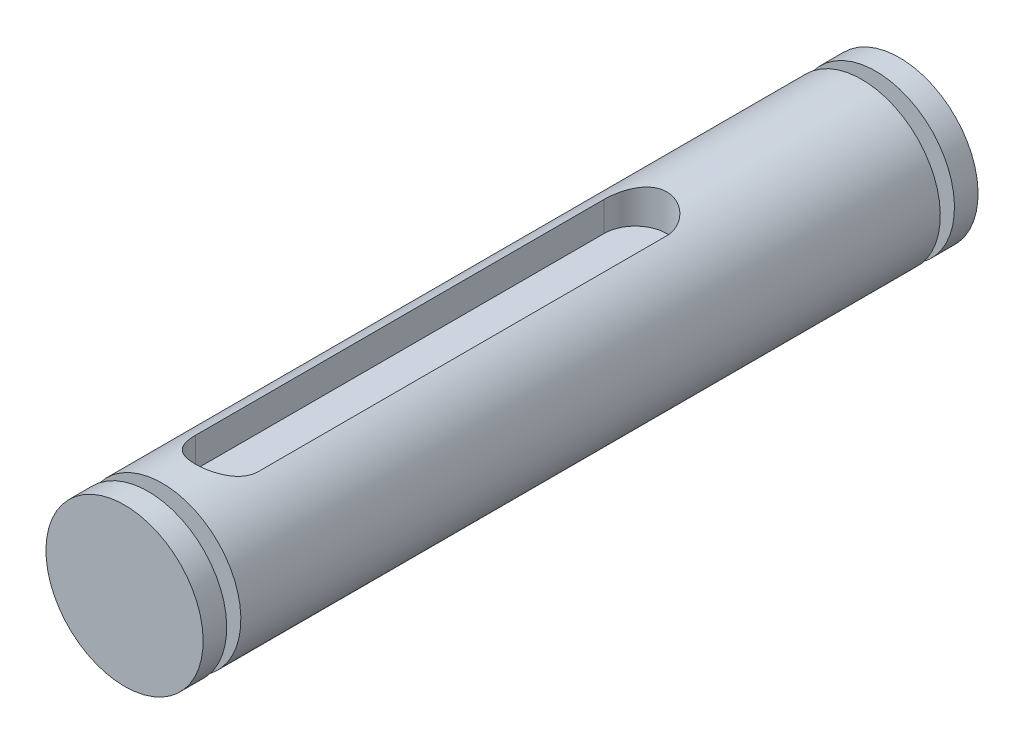
ISO-10303-21;
HEADER;
FILE_DESCRIPTION(('STEP AP214'),'2;1');
FILE_NAME('part.step','',(''),(''),'','','');
FILE_SCHEMA(('AUTOMOTIVE_DESIGN { 1 0 10303 214 1 1 1 1 }'));
ENDSEC;
DATA;
#1=APPLICATION_CONTEXT('core data for automotive mechanical design processes');
#2=APPLICATION_PROTOCOL_DEFINITION('international standard','automotive_design',2000,#1);
#3=PRODUCT_CONTEXT('',#1,'mechanical');
#4=PRODUCT('Part','Part','',(#3));
#5=PRODUCT_RELATED_PRODUCT_CATEGORY('part','',(#4));
#6=PRODUCT_DEFINITION_FORMATION('','',#4);
#7=PRODUCT_DEFINITION_CONTEXT('part definition',#1,'design');
#8=PRODUCT_DEFINITION('design','',#6,#7);
#9=PRODUCT_DEFINITION_SHAPE('','',#8);
#10=(LENGTH_UNIT() NAMED_UNIT(*) SI_UNIT(.MILLI.,.METRE.));
#11=(NAMED_UNIT(*) PLANE_ANGLE_UNIT() SI_UNIT($,.RADIAN.));
#12=(NAMED_UNIT(*) SI_UNIT($,.STERADIAN.) SOLID_ANGLE_UNIT());
#13=UNCERTAINTY_MEASURE_WITH_UNIT(LENGTH_MEASURE(1.E-05),#10,'distance_accuracy_value','');
#14=(GEOMETRIC_REPRESENTATION_CONTEXT(3) GLOBAL_UNCERTAINTY_ASSIGNED_CONTEXT((#13)) GLOBAL_UNIT_ASSIGNED_CONTEXT((#10,
#11,#12)) REPRESENTATION_CONTEXT('',''));
#15=CARTESIAN_POINT('',(0.,0.,0.));
#16=DIRECTION('',(0.,0.,1.));
#17=DIRECTION('',(1.,0.,0.));
#18=AXIS2_PLACEMENT_3D('',#15,#16,#17);
#19=CARTESIAN_POINT('',(0.,0.,0.));
#20=DIRECTION('',(0.,0.,1.));
#21=DIRECTION('',(0.,-1.,0.));
#22=AXIS2_PLACEMENT_3D('',#19,#20,#21);
#23=PLANE('',#22);
#24=CARTESIAN_POINT('',(0.,0.,0.));
#25=DIRECTION('',(0.,0.,1.));
#26=DIRECTION('',(0.,-1.,0.));
#27=AXIS2_PLACEMENT_3D('',#24,#25,#26);
#28=CIRCLE('',#27,5.);
#29=CARTESIAN_POINT('',(0.,-5.,0.));
#30=VERTEX_POINT('',#29);
#31=EDGE_CURVE('E20',#30,#30,#28,.F.);
#32=ORIENTED_EDGE('',*,*,#31,.F.);
#33=EDGE_LOOP('',(#32));
#34=FACE_BOUND('',#33,.T.);
#35=ADVANCED_FACE('F17',(#34),#23,.T.);
#36=CARTESIAN_POINT('',(0.,5.00000000000001,-49.3));
#37=DIRECTION('',(0.,0.,-1.));
#38=DIRECTION('',(0.,1.,0.));
#39=AXIS2_PLACEMENT_3D('',#36,#37,#38);
#40=PLANE('',#39);
#41=CARTESIAN_POINT('',(0.,0.,-49.3));
#42=DIRECTION('',(0.,0.,1.));
#43=DIRECTION('',(0.,-1.,0.));
#44=AXIS2_PLACEMENT_3D('',#41,#42,#43);
#45=CIRCLE('',#44,5.);
#46=CARTESIAN_POINT('',(0.,-4.99999999999999,-49.3));
#47=VERTEX_POINT('',#46);
#48=EDGE_CURVE('E143',#47,#47,#45,.T.);
#49=ORIENTED_EDGE('',*,*,#48,.F.);
#50=EDGE_LOOP('',(#49));
#51=FACE_BOUND('',#50,.T.);
#52=ADVANCED_FACE('F153',(#51),#40,.T.);
#53=CARTESIAN_POINT('',(0.,0.,-0.750000000000002));
#54=DIRECTION('',(0.,0.,1.));
#55=DIRECTION('',(0.,-1.,0.));
#56=AXIS2_PLACEMENT_3D('',#53,#54,#55);
#57=CYLINDRICAL_SURFACE('',#56,5.);
#58=CARTESIAN_POINT('',(0.,0.,-1.5));
#59=DIRECTION('',(0.,0.,1.));
#60=DIRECTION('',(0.,-1.,0.));
#61=AXIS2_PLACEMENT_3D('',#58,#59,#60);
#62=CIRCLE('',#61,5.);
#63=CARTESIAN_POINT('',(0.,-5.,-1.5));
#64=VERTEX_POINT('',#63);
#65=EDGE_CURVE('E141',#64,#64,#62,.F.);
#66=ORIENTED_EDGE('',*,*,#65,.F.);
#67=EDGE_LOOP('',(#66));
#68=FACE_BOUND('',#67,.T.);
#69=ORIENTED_EDGE('',*,*,#31,.T.);
#70=EDGE_LOOP('',(#69));
#71=FACE_BOUND('',#70,.T.);
#72=ADVANCED_FACE('F150',(#68,#71),#57,.T.);
#73=CARTESIAN_POINT('',(0.,0.,-48.55));
#74=DIRECTION('',(0.,0.,1.));
#75=DIRECTION('',(0.,-1.,0.));
#76=AXIS2_PLACEMENT_3D('',#73,#74,#75);
#77=CYLINDRICAL_SURFACE('',#76,5.);
#78=ORIENTED_EDGE('',*,*,#48,.T.);
#79=EDGE_LOOP('',(#78));
#80=FACE_BOUND('',#79,.T.);
#81=CARTESIAN_POINT('',(0.,0.,-47.8));
#82=DIRECTION('',(0.,0.,1.));
#83=DIRECTION('',(0.,-1.,0.));
#84=AXIS2_PLACEMENT_3D('',#81,#82,#83);
#85=CIRCLE('',#84,5.);
#86=CARTESIAN_POINT('',(0.,-4.99999999999999,-47.8));
#87=VERTEX_POINT('',#86);
#88=EDGE_CURVE('E138',#87,#87,#85,.T.);
#89=ORIENTED_EDGE('',*,*,#88,.F.);
#90=EDGE_LOOP('',(#89));
#91=FACE_BOUND('',#90,.T.);
#92=ADVANCED_FACE('F161',(#80,#91),#77,.T.);
#93=CARTESIAN_POINT('',(0.,5.00000000000001,-1.5));
#94=DIRECTION('',(0.,0.,-1.));
#95=DIRECTION('',(0.,1.,0.));
#96=AXIS2_PLACEMENT_3D('',#93,#94,#95);
#97=PLANE('',#96);
#98=CARTESIAN_POINT('',(0.,0.,-1.5));
#99=DIRECTION('',(0.,0.,1.));
#100=DIRECTION('',(0.,-1.,0.));
#101=AXIS2_PLACEMENT_3D('',#98,#99,#100);
#102=CIRCLE('',#101,3.54999999999999);
#103=CARTESIAN_POINT('',(0.,-3.54999999999999,-1.5));
#104=VERTEX_POINT('',#103);
#105=EDGE_CURVE('E135',#104,#104,#102,.F.);
#106=ORIENTED_EDGE('',*,*,#105,.F.);
#107=EDGE_LOOP('',(#106));
#108=FACE_BOUND('',#107,.T.);
#109=ORIENTED_EDGE('',*,*,#65,.T.);
#110=EDGE_LOOP('',(#109));
#111=FACE_BOUND('',#110,.T.);
#112=ADVANCED_FACE('F167',(#108,#111),#97,.T.);
#113=CARTESIAN_POINT('',(0.,3.55000000000001,-47.8));
#114=DIRECTION('',(0.,0.,1.));
#115=DIRECTION('',(0.,-1.,0.));
#116=AXIS2_PLACEMENT_3D('',#113,#114,#115);
#117=PLANE('',#116);
#118=CARTESIAN_POINT('',(0.,0.,-47.8));
#119=DIRECTION('',(0.,0.,1.));
#120=DIRECTION('',(0.,-1.,0.));
#121=AXIS2_PLACEMENT_3D('',#118,#119,#120);
#122=CIRCLE('',#121,3.55);
#123=CARTESIAN_POINT('',(0.,-3.54999999999999,-47.8));
#124=VERTEX_POINT('',#123);
#125=EDGE_CURVE('E132',#124,#124,#122,.T.);
#126=ORIENTED_EDGE('',*,*,#125,.F.);
#127=EDGE_LOOP('',(#126));
#128=FACE_BOUND('',#127,.T.);
#129=ORIENTED_EDGE('',*,*,#88,.T.);
#130=EDGE_LOOP('',(#129));
#131=FACE_BOUND('',#130,.T.);
#132=ADVANCED_FACE('F170',(#128,#131),#117,.T.);
#133=CARTESIAN_POINT('',(0.,0.,-1.95));
#134=DIRECTION('',(0.,0.,1.));
#135=DIRECTION('',(0.,-1.,0.));
#136=AXIS2_PLACEMENT_3D('',#133,#134,#135);
#137=CYLINDRICAL_SURFACE('',#136,3.54999999999999);
#138=CARTESIAN_POINT('',(0.,0.,-2.4));
#139=DIRECTION('',(0.,0.,1.));
#140=DIRECTION('',(0.,-1.,0.));
#141=AXIS2_PLACEMENT_3D('',#138,#139,#140);
#142=CIRCLE('',#141,3.54999999999999);
#143=CARTESIAN_POINT('',(0.,-3.54999999999999,-2.4));
#144=VERTEX_POINT('',#143);
#145=EDGE_CURVE('E129',#144,#144,#142,.F.);
#146=ORIENTED_EDGE('',*,*,#145,.F.);
#147=EDGE_LOOP('',(#146));
#148=FACE_BOUND('',#147,.T.);
#149=ORIENTED_EDGE('',*,*,#105,.T.);
#150=EDGE_LOOP('',(#149));
#151=FACE_BOUND('',#150,.T.);
#152=ADVANCED_FACE('F174',(#148,#151),#137,.T.);
#153=CARTESIAN_POINT('',(0.,0.,-47.35));
#154=DIRECTION('',(0.,0.,1.));
#155=DIRECTION('',(0.,-1.,0.));
#156=AXIS2_PLACEMENT_3D('',#153,#154,#155);
#157=CYLINDRICAL_SURFACE('',#156,3.55);
#158=ORIENTED_EDGE('',*,*,#125,.T.);
#159=EDGE_LOOP('',(#158));
#160=FACE_BOUND('',#159,.T.);
#161=CARTESIAN_POINT('',(0.,0.,-46.9));
#162=DIRECTION('',(0.,0.,1.));
#163=DIRECTION('',(0.,-1.,0.));
#164=AXIS2_PLACEMENT_3D('',#161,#162,#163);
#165=CIRCLE('',#164,3.55);
#166=CARTESIAN_POINT('',(0.,-3.54999999999999,-46.9));
#167=VERTEX_POINT('',#166);
#168=EDGE_CURVE('E73',#167,#167,#165,.T.);
#169=ORIENTED_EDGE('',*,*,#168,.F.);
#170=EDGE_LOOP('',(#169));
#171=FACE_BOUND('',#170,.T.);
#172=ADVANCED_FACE('F178',(#160,#171),#157,.T.);
#173=CARTESIAN_POINT('',(0.,2.7,-19.5));
#174=DIRECTION('',(0.,1.,0.));
#175=DIRECTION('',(0.,0.,1.));
#176=AXIS2_PLACEMENT_3D('',#173,#174,#175);
#177=PLANE('',#176);
#178=CARTESIAN_POINT('',(0.,2.7,-6.5));
#179=DIRECTION('',(0.,-1.,0.));
#180=DIRECTION('',(0.,0.,-1.));
#181=AXIS2_PLACEMENT_3D('',#178,#179,#180);
#182=CIRCLE('',#181,2.);
#183=CARTESIAN_POINT('',(-1.99999999999999,2.7,-6.5));
#184=VERTEX_POINT('',#183);
#185=CARTESIAN_POINT('',(2.,2.7,-6.5));
#186=VERTEX_POINT('',#185);
#187=EDGE_CURVE('E59',#184,#186,#182,.F.);
#188=ORIENTED_EDGE('',*,*,#187,.T.);
#189=DIRECTION('',(0.,0.,-1.));
#190=VECTOR('',#189,1.);
#191=CARTESIAN_POINT('',(2.,2.7,-32.5));
#192=LINE('',#191,#190);
#193=CARTESIAN_POINT('',(2.,2.7,-32.5));
#194=VERTEX_POINT('',#193);
#195=EDGE_CURVE('E85',#186,#194,#192,.T.);
#196=ORIENTED_EDGE('',*,*,#195,.T.);
#197=CARTESIAN_POINT('',(0.,2.7,-32.5));
#198=DIRECTION('',(0.,-1.,0.));
#199=DIRECTION('',(0.,0.,-1.));
#200=AXIS2_PLACEMENT_3D('',#197,#198,#199);
#201=CIRCLE('',#200,2.);
#202=CARTESIAN_POINT('',(-2.,2.7,-32.5));
#203=VERTEX_POINT('',#202);
#204=EDGE_CURVE('E61',#194,#203,#201,.F.);
#205=ORIENTED_EDGE('',*,*,#204,.T.);
#206=DIRECTION('',(0.,0.,1.));
#207=VECTOR('',#206,1.);
#208=CARTESIAN_POINT('',(-1.99999999999999,2.7,-6.5));
#209=LINE('',#208,#207);
#210=EDGE_CURVE('E56',#203,#184,#209,.T.);
#211=ORIENTED_EDGE('',*,*,#210,.T.);
#212=EDGE_LOOP('',(#188,#196,#205,#211));
#213=FACE_BOUND('',#212,.T.);
#214=ADVANCED_FACE('F58',(#213),#177,.T.);
#215=CARTESIAN_POINT('',(0.,3.55,-2.4));
#216=DIRECTION('',(0.,0.,1.));
#217=DIRECTION('',(0.,-1.,0.));
#218=AXIS2_PLACEMENT_3D('',#215,#216,#217);
#219=PLANE('',#218);
#220=ORIENTED_EDGE('',*,*,#145,.T.);
#221=EDGE_LOOP('',(#220));
#222=FACE_BOUND('',#221,.T.);
#223=CARTESIAN_POINT('',(0.,0.,-2.4));
#224=DIRECTION('',(0.,0.,1.));
#225=DIRECTION('',(0.,-1.,0.));
#226=AXIS2_PLACEMENT_3D('',#223,#224,#225);
#227=CIRCLE('',#226,5.);
#228=CARTESIAN_POINT('',(0.,-5.,-2.4));
#229=VERTEX_POINT('',#228);
#230=EDGE_CURVE('E116',#229,#229,#227,.F.);
#231=ORIENTED_EDGE('',*,*,#230,.F.);
#232=EDGE_LOOP('',(#231));
#233=FACE_BOUND('',#232,.T.);
#234=ADVANCED_FACE('F185',(#222,#233),#219,.T.);
#235=CARTESIAN_POINT('',(0.,5.00000000000001,-46.9));
#236=DIRECTION('',(0.,0.,-1.));
#237=DIRECTION('',(0.,1.,0.));
#238=AXIS2_PLACEMENT_3D('',#235,#236,#237);
#239=PLANE('',#238);
#240=ORIENTED_EDGE('',*,*,#168,.T.);
#241=EDGE_LOOP('',(#240));
#242=FACE_BOUND('',#241,.T.);
#243=CARTESIAN_POINT('',(0.,0.,-46.9));
#244=DIRECTION('',(0.,0.,1.));
#245=DIRECTION('',(0.,-1.,0.));
#246=AXIS2_PLACEMENT_3D('',#243,#244,#245);
#247=CIRCLE('',#246,5.);
#248=CARTESIAN_POINT('',(0.,-4.99999999999999,-46.9));
#249=VERTEX_POINT('',#248);
#250=EDGE_CURVE('E119',#249,#249,#247,.T.);
#251=ORIENTED_EDGE('',*,*,#250,.F.);
#252=EDGE_LOOP('',(#251));
#253=FACE_BOUND('',#252,.T.);
#254=ADVANCED_FACE('F188',(#242,#253),#239,.T.);
#255=CARTESIAN_POINT('',(0.,5.,-6.5));
#256=DIRECTION('',(0.,-1.,0.));
#257=DIRECTION('',(0.,0.,-1.));
#258=AXIS2_PLACEMENT_3D('',#255,#256,#257);
#259=CYLINDRICAL_SURFACE('',#258,2.);
#260=DIRECTION('',(0.,1.,0.));
#261=VECTOR('',#260,1.);
#262=CARTESIAN_POINT('',(2.,5.,-6.5));
#263=LINE('',#262,#261);
#264=CARTESIAN_POINT('',(2.,4.58257569495584,-6.5));
#265=VERTEX_POINT('',#264);
#266=EDGE_CURVE('E71',#265,#186,#263,.F.);
#267=ORIENTED_EDGE('',*,*,#266,.T.);
#268=ORIENTED_EDGE('',*,*,#187,.F.);
#269=DIRECTION('',(0.,1.,0.));
#270=VECTOR('',#269,1.);
#271=CARTESIAN_POINT('',(-1.99999999999999,5.,-6.5));
#272=LINE('',#271,#270);
#273=CARTESIAN_POINT('',(-1.99999999999999,4.58257569495585,-6.5));
#274=VERTEX_POINT('',#273);
#275=EDGE_CURVE('E65',#184,#274,#272,.T.);
#276=ORIENTED_EDGE('',*,*,#275,.T.);
#277=CARTESIAN_POINT('',(2.,4.58257569495584,-6.5));
#278=CARTESIAN_POINT('',(2.00000798036347,4.58256464470381,-6.44619414749741));
#279=CARTESIAN_POINT('',(1.99782891366025,4.58352306077323,-6.39239433444235));
#280=CARTESIAN_POINT('',(1.98915905973447,4.58729625417543,-6.2852287017453));
#281=CARTESIAN_POINT('',(1.98266991468792,4.59011032448545,-6.23186272464397));
#282=CARTESIAN_POINT('',(1.9654760367637,4.5974978292064,-6.12615317844121));
#283=CARTESIAN_POINT('',(1.95478796820434,4.60206430717533,-6.07380641595597));
#284=CARTESIAN_POINT('',(1.9293163019066,4.61280053296682,-5.97029922828554));
#285=CARTESIAN_POINT('',(1.9145324541709,4.61897037865398,-5.91913887572283));
#286=CARTESIAN_POINT('',(1.86426971793523,4.63959291248421,-5.76806414941803));
#287=CARTESIAN_POINT('',(1.82284489460008,4.65617449157431,-5.67034576931025));
#288=CARTESIAN_POINT('',(1.72548191592176,4.6931237076538,-5.48320441991737));
#289=CARTESIAN_POINT('',(1.66952996336925,4.71349493864007,-5.39378944703834));
#290=CARTESIAN_POINT('',(1.54131835736854,4.75700999402114,-5.22073760332578));
#291=CARTESIAN_POINT('',(1.4683691399273,4.78024245635516,-5.13763278307977));
#292=CARTESIAN_POINT('',(1.30969646176209,4.82612790548656,-4.98445972778927));
#293=CARTESIAN_POINT('',(1.22397038499682,4.84878077249721,-4.91439416913425));
#294=CARTESIAN_POINT('',(1.03800590808969,4.89203417106082,-4.78659360580435));
#295=CARTESIAN_POINT('',(0.93732793305096,4.91251824543531,-4.72945519073807));
#296=CARTESIAN_POINT('',(0.726824143246708,4.94803944125004,-4.63315592731136));
#297=CARTESIAN_POINT('',(0.617002169026243,4.96307883544185,-4.59398757594832));
#298=CARTESIAN_POINT('',(0.396967441295689,4.98538314653816,-4.53665879868942));
#299=CARTESIAN_POINT('',(0.287031054523058,4.99298922547927,-4.51757304909434));
#300=CARTESIAN_POINT('',(0.0652684304565134,5.00080310201086,-4.49797152005439));
#301=CARTESIAN_POINT('',(-0.0465571232841672,5.0010135205303,-4.49744916197646));
#302=CARTESIAN_POINT('',(-0.262233376226786,4.99421960045302,-4.51448283915986));
#303=CARTESIAN_POINT('',(-0.366179202506793,4.98761985585461,-4.53102504667401));
#304=CARTESIAN_POINT('',(-0.569674786500931,4.96849270441446,-4.57999342705354));
#305=CARTESIAN_POINT('',(-0.669224295072844,4.95596496209929,-4.61242049886861));
#306=CARTESIAN_POINT('',(-0.862897539070297,4.92596830598785,-4.69263629642451));
#307=CARTESIAN_POINT('',(-0.956916851366441,4.90842774755848,-4.74064924081046));
#308=CARTESIAN_POINT('',(-1.13580746919776,4.87014602008043,-4.85046458859515));
#309=CARTESIAN_POINT('',(-1.22067554984698,4.84940372896448,-4.91227182969058));
#310=CARTESIAN_POINT('',(-1.38476339273627,4.80521782746144,-5.05264418025852));
#311=CARTESIAN_POINT('',(-1.4632477030894,4.78168627172884,-5.13204247467003));
#312=CARTESIAN_POINT('',(-1.60609926099478,4.7356195058465,-5.30298009514767));
#313=CARTESIAN_POINT('',(-1.67046007709005,4.71308475332783,-5.39452492209426));
#314=CARTESIAN_POINT('',(-1.78493657933605,4.67095688856025,-5.59047028402121));
#315=CARTESIAN_POINT('',(-1.83458932217622,4.65146702150583,-5.69516483666021));
#316=CARTESIAN_POINT('',(-1.91521298357264,4.61886105059582,-5.91236152442947));
#317=CARTESIAN_POINT('',(-1.94621696002208,4.60573367628738,-6.0248494473383));
#318=CARTESIAN_POINT('',(-1.9781058182572,4.59208303529493,-6.19874363415798));
#319=CARTESIAN_POINT('',(-1.98630505165979,4.58853437680526,-6.25865754930133));
#320=CARTESIAN_POINT('',(-1.99725282103812,4.58377540314389,-6.37903501899554));
#321=CARTESIAN_POINT('',(-2.00000471568568,4.58256364711745,-6.43949821175783));
#322=CARTESIAN_POINT('',(-2.,4.58257569495584,-6.5));
#323=B_SPLINE_CURVE_WITH_KNOTS('',3,(#277,#278,#279,#280,#281,#282,#283,#284,#285,#286,#287,
#288,#289,#290,#291,#292,#293,#294,#295,#296,#297,#298,#299,#300,#301,#302,#303,#304,#305,#306,
#307,#308,#309,#310,#311,#312,#313,#314,#315,#316,#317,#318,#319,#320,#321,#322),.UNSPECIFIED.,
.F.,.F.,(4,2,2,2,2,2,2,2,2,2,2,2,2,2,2,2,2,2,2,2,2,2,4),(0.,0.161354853098824,0.322648263883208,
0.483307911251882,0.643977367092306,0.964683001739096,1.28569434942626,1.62318047995498,
1.96073580539191,2.31162858925764,2.66237473197323,2.9961387650427,3.32978451514656,
3.64468915259535,3.95961161305654,4.27928176927547,4.59906421133019,4.93981874675153,
5.28072813203934,5.63144241548462,5.98153315592125,6.16300192557813,6.3443587719356),.UNSPECIFIED.);
#324=EDGE_CURVE('E94',#265,#274,#323,.T.);
#325=ORIENTED_EDGE('',*,*,#324,.F.);
#326=EDGE_LOOP('',(#267,#268,#276,#325));
#327=FACE_BOUND('',#326,.T.);
#328=ADVANCED_FACE('F68',(#327),#259,.F.);
#329=CARTESIAN_POINT('',(-1.99999999999999,5.,-6.5));
#330=DIRECTION('',(-1.,0.,0.));
#331=DIRECTION('',(0.,0.,1.));
#332=AXIS2_PLACEMENT_3D('',#329,#330,#331);
#333=PLANE('',#332);
#334=ORIENTED_EDGE('',*,*,#275,.F.);
#335=ORIENTED_EDGE('',*,*,#210,.F.);
#336=DIRECTION('',(0.,-1.,0.));
#337=VECTOR('',#336,1.);
#338=CARTESIAN_POINT('',(-2.,5.,-32.5));
#339=LINE('',#338,#337);
#340=CARTESIAN_POINT('',(-2.,4.58257569495585,-32.5));
#341=VERTEX_POINT('',#340);
#342=EDGE_CURVE('E80',#203,#341,#339,.F.);
#343=ORIENTED_EDGE('',*,*,#342,.T.);
#344=DIRECTION('',(0.,0.,1.));
#345=VECTOR('',#344,1.);
#346=CARTESIAN_POINT('',(-1.99999999999999,4.58257569495585,-24.65));
#347=LINE('',#346,#345);
#348=EDGE_CURVE('E77',#274,#341,#347,.F.);
#349=ORIENTED_EDGE('',*,*,#348,.F.);
#350=EDGE_LOOP('',(#334,#335,#343,#349));
#351=FACE_BOUND('',#350,.T.);
#352=ADVANCED_FACE('F75',(#351),#333,.F.);
#353=CARTESIAN_POINT('',(0.,5.,-32.5));
#354=DIRECTION('',(0.,-1.,0.));
#355=DIRECTION('',(0.,0.,-1.));
#356=AXIS2_PLACEMENT_3D('',#353,#354,#355);
#357=CYLINDRICAL_SURFACE('',#356,2.);
#358=ORIENTED_EDGE('',*,*,#342,.F.);
#359=ORIENTED_EDGE('',*,*,#204,.F.);
#360=DIRECTION('',(0.,1.,0.));
#361=VECTOR('',#360,1.);
#362=CARTESIAN_POINT('',(2.,5.,-32.5));
#363=LINE('',#362,#361);
#364=CARTESIAN_POINT('',(2.,4.58257569495585,-32.5));
#365=VERTEX_POINT('',#364);
#366=EDGE_CURVE('E35',#194,#365,#363,.T.);
#367=ORIENTED_EDGE('',*,*,#366,.T.);
#368=CARTESIAN_POINT('',(-2.,4.58257569495585,-32.5));
#369=CARTESIAN_POINT('',(-2.00000798036348,4.58256464470382,-32.5538058525026));
#370=CARTESIAN_POINT('',(-1.99782891366025,4.58352306077323,-32.6076056655576));
#371=CARTESIAN_POINT('',(-1.98915905973447,4.58729625417544,-32.7147712982547));
#372=CARTESIAN_POINT('',(-1.98266991468793,4.59011032448546,-32.768137275356));
#373=CARTESIAN_POINT('',(-1.9654760367637,4.5974978292064,-32.8738468215588));
#374=CARTESIAN_POINT('',(-1.95478796820434,4.60206430717533,-32.926193584044));
#375=CARTESIAN_POINT('',(-1.92931630190661,4.61280053296683,-33.0297007717145));
#376=CARTESIAN_POINT('',(-1.91453245417091,4.61897037865399,-33.0808611242772));
#377=CARTESIAN_POINT('',(-1.86426971793523,4.63959291248422,-33.231935850582));
#378=CARTESIAN_POINT('',(-1.82284489460008,4.65617449157431,-33.3296542306897));
#379=CARTESIAN_POINT('',(-1.72548191592177,4.6931237076538,-33.5167955800826));
#380=CARTESIAN_POINT('',(-1.66952996336926,4.71349493864008,-33.6062105529617));
#381=CARTESIAN_POINT('',(-1.54131835736855,4.75700999402115,-33.7792623966742));
#382=CARTESIAN_POINT('',(-1.4683691399273,4.78024245635517,-33.8623672169202));
#383=CARTESIAN_POINT('',(-1.30969646176209,4.82612790548656,-34.0155402722107));
#384=CARTESIAN_POINT('',(-1.22397038499682,4.84878077249721,-34.0856058308657));
#385=CARTESIAN_POINT('',(-1.03800590808969,4.89203417106083,-34.2134063941956));
#386=CARTESIAN_POINT('',(-0.93732793305097,4.91251824543531,-34.2705448092619));
#387=CARTESIAN_POINT('',(-0.726824143246718,4.94803944125004,-34.3668440726886));
#388=CARTESIAN_POINT('',(-0.617002169026252,4.96307883544185,-34.4060124240517));
#389=CARTESIAN_POINT('',(-0.396967441295697,4.98538314653816,-34.4633412013106));
#390=CARTESIAN_POINT('',(-0.287031054523065,4.99298922547928,-34.4824269509057));
#391=CARTESIAN_POINT('',(-0.0652684304565203,5.00080310201086,-34.5020284799456));
#392=CARTESIAN_POINT('',(0.046557123284161,5.0010135205303,-34.5025508380235));
#393=CARTESIAN_POINT('',(0.262233376226781,4.99421960045303,-34.4855171608401));
#394=CARTESIAN_POINT('',(0.366179202506788,4.98761985585462,-34.468974953326));
#395=CARTESIAN_POINT('',(0.569674786500926,4.96849270441447,-34.4200065729465));
#396=CARTESIAN_POINT('',(0.669224295072839,4.9559649620993,-34.3875795011314));
#397=CARTESIAN_POINT('',(0.86289753907029,4.92596830598786,-34.3073637035755));
#398=CARTESIAN_POINT('',(0.956916851366434,4.90842774755848,-34.2593507591895));
#399=CARTESIAN_POINT('',(1.13580746919776,4.87014602008044,-34.1495354114049));
#400=CARTESIAN_POINT('',(1.22067554984697,4.84940372896449,-34.0877281703094));
#401=CARTESIAN_POINT('',(1.38476339273626,4.80521782746144,-33.9473558197415));
#402=CARTESIAN_POINT('',(1.46324770308939,4.78168627172885,-33.86795752533));
#403=CARTESIAN_POINT('',(1.60609926099477,4.73561950584651,-33.6970199048523));
#404=CARTESIAN_POINT('',(1.67046007709005,4.71308475332783,-33.6054750779057));
#405=CARTESIAN_POINT('',(1.78493657933605,4.67095688856025,-33.4095297159788));
#406=CARTESIAN_POINT('',(1.83458932217622,4.65146702150584,-33.3048351633398));
#407=CARTESIAN_POINT('',(1.91521298357264,4.61886105059582,-33.0876384755705));
#408=CARTESIAN_POINT('',(1.94621696002208,4.60573367628738,-32.9751505526617));
#409=CARTESIAN_POINT('',(1.9781058182572,4.59208303529493,-32.801256365842));
#410=CARTESIAN_POINT('',(1.98630505165979,4.58853437680527,-32.7413424506987));
#411=CARTESIAN_POINT('',(1.99725282103812,4.58377540314389,-32.6209649810045));
#412=CARTESIAN_POINT('',(2.00000471568568,4.58256364711745,-32.5605017882422));
#413=CARTESIAN_POINT('',(2.,4.58257569495585,-32.5));
#414=B_SPLINE_CURVE_WITH_KNOTS('',3,(#368,#369,#370,#371,#372,#373,#374,#375,#376,#377,#378,
#379,#380,#381,#382,#383,#384,#385,#386,#387,#388,#389,#390,#391,#392,#393,#394,#395,#396,#397,
#398,#399,#400,#401,#402,#403,#404,#405,#406,#407,#408,#409,#410,#411,#412,#413),.UNSPECIFIED.,
.F.,.F.,(4,2,2,2,2,2,2,2,2,2,2,2,2,2,2,2,2,2,2,2,2,2,4),(0.,0.161354853098824,0.322648263883208,
0.483307911251876,0.643977367092303,0.964683001739086,1.28569434942625,1.62318047995498,
1.9607358053919,2.31162858925763,2.66237473197322,2.99613876504269,3.32978451514655,
3.64468915259535,3.95961161305654,4.27928176927546,4.59906421133018,4.93981874675153,
5.28072813203933,5.63144241548462,5.98153315592124,6.16300192557813,6.34435877193561),.UNSPECIFIED.);
#415=EDGE_CURVE('E26',#341,#365,#414,.T.);
#416=ORIENTED_EDGE('',*,*,#415,.F.);
#417=EDGE_LOOP('',(#358,#359,#367,#416));
#418=FACE_BOUND('',#417,.T.);
#419=ADVANCED_FACE('F100',(#418),#357,.F.);
#420=CARTESIAN_POINT('',(2.,5.,-32.5));
#421=DIRECTION('',(1.,0.,0.));
#422=DIRECTION('',(0.,0.,-1.));
#423=AXIS2_PLACEMENT_3D('',#420,#421,#422);
#424=PLANE('',#423);
#425=ORIENTED_EDGE('',*,*,#366,.F.);
#426=ORIENTED_EDGE('',*,*,#195,.F.);
#427=ORIENTED_EDGE('',*,*,#266,.F.);
#428=DIRECTION('',(0.,0.,1.));
#429=VECTOR('',#428,1.);
#430=CARTESIAN_POINT('',(2.,4.58257569495585,-24.65));
#431=LINE('',#430,#429);
#432=EDGE_CURVE('E11',#365,#265,#431,.T.);
#433=ORIENTED_EDGE('',*,*,#432,.F.);
#434=EDGE_LOOP('',(#425,#426,#427,#433));
#435=FACE_BOUND('',#434,.T.);
#436=ADVANCED_FACE('F107',(#435),#424,.F.);
#437=CARTESIAN_POINT('',(0.,0.,-24.65));
#438=DIRECTION('',(0.,0.,1.));
#439=DIRECTION('',(0.,-1.,0.));
#440=AXIS2_PLACEMENT_3D('',#437,#438,#439);
#441=CYLINDRICAL_SURFACE('',#440,5.);
#442=ORIENTED_EDGE('',*,*,#250,.T.);
#443=EDGE_LOOP('',(#442));
#444=FACE_BOUND('',#443,.T.);
#445=ORIENTED_EDGE('',*,*,#415,.T.);
#446=ORIENTED_EDGE('',*,*,#432,.T.);
#447=ORIENTED_EDGE('',*,*,#324,.T.);
#448=ORIENTED_EDGE('',*,*,#348,.T.);
#449=EDGE_LOOP('',(#445,#446,#447,#448));
#450=FACE_BOUND('',#449,.T.);
#451=ORIENTED_EDGE('',*,*,#230,.T.);
#452=EDGE_LOOP('',(#451));
#453=FACE_BOUND('',#452,.T.);
#454=ADVANCED_FACE('F104',(#444,#450,#453),#441,.T.);
#455=CLOSED_SHELL('',(#35,#52,#72,#92,#112,#132,#152,#172,#214,#234,#254,#328,#352,#419,#436,#454));
#456=MANIFOLD_SOLID_BREP('B1',#455);
#457=ADVANCED_BREP_SHAPE_REPRESENTATION('',(#18,#456),#14);
#458=SHAPE_DEFINITION_REPRESENTATION(#9,#457);
ENDSEC;
END-ISO-10303-21;
